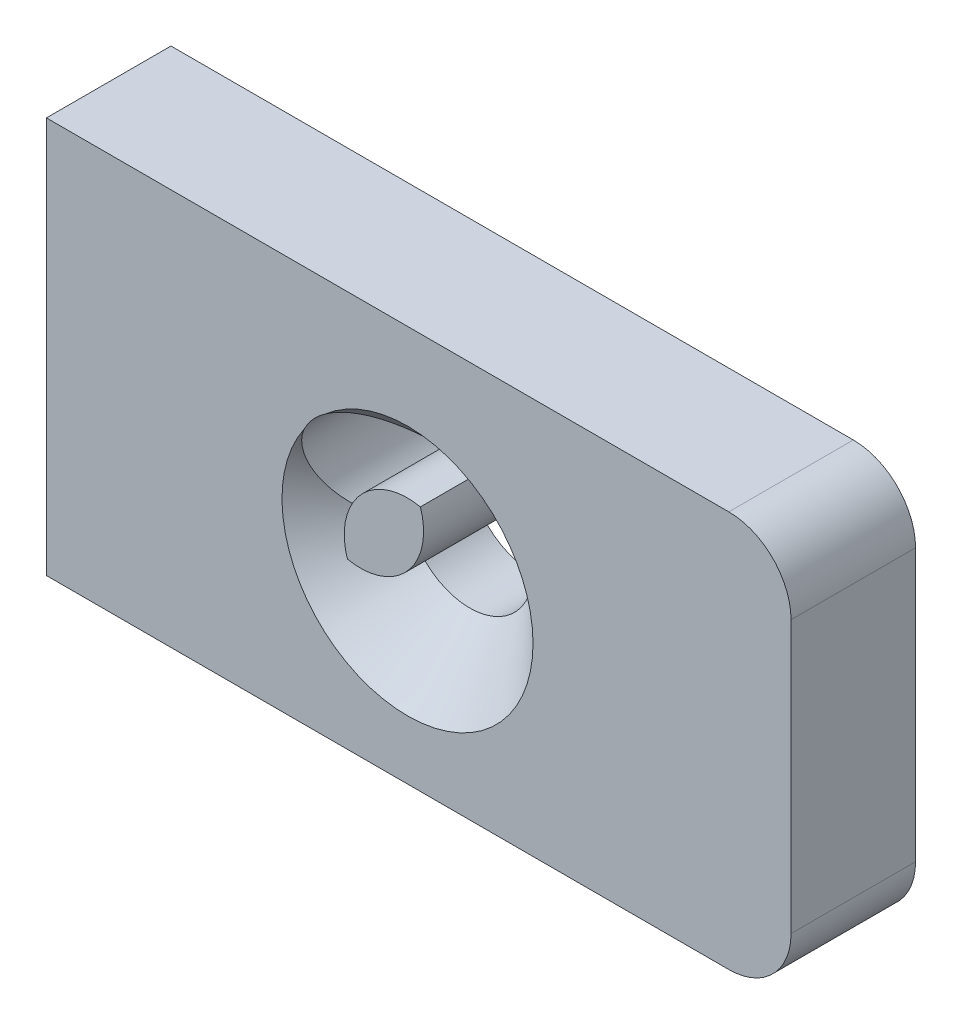
ISO-10303-21;
HEADER;
FILE_DESCRIPTION(('STEP AP214'),'2;1');
FILE_NAME('part.step','',(''),(''),'','','');
FILE_SCHEMA(('AUTOMOTIVE_DESIGN { 1 0 10303 214 1 1 1 1 }'));
ENDSEC;
DATA;
#1=APPLICATION_CONTEXT('core data for automotive mechanical design processes');
#2=APPLICATION_PROTOCOL_DEFINITION('international standard','automotive_design',2000,#1);
#3=PRODUCT_CONTEXT('',#1,'mechanical');
#4=PRODUCT('Part','Part','',(#3));
#5=PRODUCT_RELATED_PRODUCT_CATEGORY('part','',(#4));
#6=PRODUCT_DEFINITION_FORMATION('','',#4);
#7=PRODUCT_DEFINITION_CONTEXT('part definition',#1,'design');
#8=PRODUCT_DEFINITION('design','',#6,#7);
#9=PRODUCT_DEFINITION_SHAPE('','',#8);
#10=(LENGTH_UNIT() NAMED_UNIT(*) SI_UNIT(.MILLI.,.METRE.));
#11=(NAMED_UNIT(*) PLANE_ANGLE_UNIT() SI_UNIT($,.RADIAN.));
#12=(NAMED_UNIT(*) SI_UNIT($,.STERADIAN.) SOLID_ANGLE_UNIT());
#13=UNCERTAINTY_MEASURE_WITH_UNIT(LENGTH_MEASURE(1.E-05),#10,'distance_accuracy_value','');
#14=(GEOMETRIC_REPRESENTATION_CONTEXT(3) GLOBAL_UNCERTAINTY_ASSIGNED_CONTEXT((#13)) GLOBAL_UNIT_ASSIGNED_CONTEXT((#10,
#11,#12)) REPRESENTATION_CONTEXT('',''));
#15=CARTESIAN_POINT('',(0.,0.,0.));
#16=DIRECTION('',(0.,0.,1.));
#17=DIRECTION('',(1.,0.,0.));
#18=AXIS2_PLACEMENT_3D('',#15,#16,#17);
#19=CARTESIAN_POINT('',(0.,0.,20.));
#20=DIRECTION('',(0.,0.,1.));
#21=DIRECTION('',(1.,0.,0.));
#22=AXIS2_PLACEMENT_3D('',#19,#20,#21);
#23=PLANE('',#22);
#24=CARTESIAN_POINT('',(-7.58038538872086,6.76617147373548,20.));
#25=DIRECTION('',(0.,0.,1.));
#26=DIRECTION('',(1.,0.,0.));
#27=AXIS2_PLACEMENT_3D('',#24,#25,#26);
#28=CIRCLE('',#27,10.1608719632483);
#29=CARTESIAN_POINT('',(-13.2357763236887,15.2077277536052,20.));
#30=VERTEX_POINT('',#29);
#31=CARTESIAN_POINT('',(-16.6075997096656,11.4301526762335,20.));
#32=VERTEX_POINT('',#31);
#33=EDGE_CURVE('E146',#30,#32,#28,.T.);
#34=ORIENTED_EDGE('',*,*,#33,.F.);
#35=CARTESIAN_POINT('',(0.,0.,20.));
#36=DIRECTION('',(0.,0.,1.));
#37=DIRECTION('',(1.,0.,0.));
#38=AXIS2_PLACEMENT_3D('',#35,#36,#37);
#39=CIRCLE('',#38,20.1608719632483);
#40=EDGE_CURVE('E13',#30,#32,#39,.F.);
#41=ORIENTED_EDGE('',*,*,#40,.T.);
#42=EDGE_LOOP('',(#34,#41));
#43=FACE_BOUND('',#42,.T.);
#44=DIRECTION('',(1.,0.,0.));
#45=VECTOR('',#44,1.);
#46=CARTESIAN_POINT('',(-57.9946898142679,-29.6417303495147,20.));
#47=LINE('',#46,#45);
#48=CARTESIAN_POINT('',(-57.9946898142679,-29.6417303495147,20.));
#49=VERTEX_POINT('',#48);
#50=CARTESIAN_POINT('',(51.6032482916,-29.6417303495147,20.));
#51=VERTEX_POINT('',#50);
#52=EDGE_CURVE('E197',#49,#51,#47,.T.);
#53=ORIENTED_EDGE('',*,*,#52,.T.);
#54=CARTESIAN_POINT('',(51.6032482916001,-19.6417303495147,20.));
#55=DIRECTION('',(0.,0.,1.));
#56=DIRECTION('',(1.,0.,0.));
#57=AXIS2_PLACEMENT_3D('',#54,#55,#56);
#58=CIRCLE('',#57,10.);
#59=CARTESIAN_POINT('',(61.6032482916001,-19.6417303495147,20.));
#60=VERTEX_POINT('',#59);
#61=EDGE_CURVE('E199',#51,#60,#58,.T.);
#62=ORIENTED_EDGE('',*,*,#61,.T.);
#63=DIRECTION('',(0.,1.,0.));
#64=VECTOR('',#63,1.);
#65=CARTESIAN_POINT('',(61.6032482916001,34.0235513577038,20.));
#66=LINE('',#65,#64);
#67=CARTESIAN_POINT('',(61.6032482916001,24.0235513577038,20.));
#68=VERTEX_POINT('',#67);
#69=EDGE_CURVE('E216',#60,#68,#66,.T.);
#70=ORIENTED_EDGE('',*,*,#69,.T.);
#71=CARTESIAN_POINT('',(51.6032482916001,24.0235513577038,20.));
#72=DIRECTION('',(0.,0.,1.));
#73=DIRECTION('',(1.,0.,0.));
#74=AXIS2_PLACEMENT_3D('',#71,#72,#73);
#75=CIRCLE('',#74,10.);
#76=CARTESIAN_POINT('',(51.6032482916,34.0235513577038,20.));
#77=VERTEX_POINT('',#76);
#78=EDGE_CURVE('E219',#68,#77,#75,.T.);
#79=ORIENTED_EDGE('',*,*,#78,.T.);
#80=DIRECTION('',(-1.,0.,0.));
#81=VECTOR('',#80,1.);
#82=CARTESIAN_POINT('',(-57.9946898142679,34.0235513577038,20.));
#83=LINE('',#82,#81);
#84=CARTESIAN_POINT('',(-57.9946898142679,34.0235513577038,20.));
#85=VERTEX_POINT('',#84);
#86=EDGE_CURVE('E234',#77,#85,#83,.T.);
#87=ORIENTED_EDGE('',*,*,#86,.T.);
#88=DIRECTION('',(0.,-1.,0.));
#89=VECTOR('',#88,1.);
#90=CARTESIAN_POINT('',(-57.9946898142679,34.0235513577038,20.));
#91=LINE('',#90,#89);
#92=EDGE_CURVE('E202',#85,#49,#91,.T.);
#93=ORIENTED_EDGE('',*,*,#92,.T.);
#94=EDGE_LOOP('',(#53,#62,#70,#79,#87,#93));
#95=FACE_BOUND('',#94,.T.);
#96=ADVANCED_FACE('F65',(#43,#95),#23,.T.);
#97=CARTESIAN_POINT('',(0.,0.,0.));
#98=DIRECTION('',(0.,0.,1.));
#99=DIRECTION('',(1.,0.,0.));
#100=AXIS2_PLACEMENT_3D('',#97,#98,#99);
#101=PLANE('',#100);
#102=DIRECTION('',(0.,1.,0.));
#103=VECTOR('',#102,1.);
#104=CARTESIAN_POINT('',(61.6032482916001,34.0235513577038,0.));
#105=LINE('',#104,#103);
#106=CARTESIAN_POINT('',(61.6032482916001,-19.6417303495147,0.));
#107=VERTEX_POINT('',#106);
#108=CARTESIAN_POINT('',(61.6032482916001,24.0235513577038,0.));
#109=VERTEX_POINT('',#108);
#110=EDGE_CURVE('E231',#107,#109,#105,.T.);
#111=ORIENTED_EDGE('',*,*,#110,.F.);
#112=CARTESIAN_POINT('',(51.6032482916001,-19.6417303495147,0.));
#113=DIRECTION('',(0.,0.,1.));
#114=DIRECTION('',(1.,0.,0.));
#115=AXIS2_PLACEMENT_3D('',#112,#113,#114);
#116=CIRCLE('',#115,10.);
#117=CARTESIAN_POINT('',(51.6032482916,-29.6417303495147,0.));
#118=VERTEX_POINT('',#117);
#119=EDGE_CURVE('E226',#107,#118,#116,.F.);
#120=ORIENTED_EDGE('',*,*,#119,.T.);
#121=DIRECTION('',(1.,0.,0.));
#122=VECTOR('',#121,1.);
#123=CARTESIAN_POINT('',(-57.9946898142679,-29.6417303495147,0.));
#124=LINE('',#123,#122);
#125=CARTESIAN_POINT('',(-57.9946898142679,-29.6417303495147,0.));
#126=VERTEX_POINT('',#125);
#127=EDGE_CURVE('E225',#126,#118,#124,.T.);
#128=ORIENTED_EDGE('',*,*,#127,.F.);
#129=DIRECTION('',(0.,-1.,0.));
#130=VECTOR('',#129,1.);
#131=CARTESIAN_POINT('',(-57.9946898142679,34.0235513577038,0.));
#132=LINE('',#131,#130);
#133=CARTESIAN_POINT('',(-57.9946898142679,34.0235513577038,0.));
#134=VERTEX_POINT('',#133);
#135=EDGE_CURVE('E159',#134,#126,#132,.T.);
#136=ORIENTED_EDGE('',*,*,#135,.F.);
#137=DIRECTION('',(-1.,0.,0.));
#138=VECTOR('',#137,1.);
#139=CARTESIAN_POINT('',(-57.9946898142679,34.0235513577038,0.));
#140=LINE('',#139,#138);
#141=CARTESIAN_POINT('',(51.6032482916,34.0235513577038,0.));
#142=VERTEX_POINT('',#141);
#143=EDGE_CURVE('E147',#142,#134,#140,.T.);
#144=ORIENTED_EDGE('',*,*,#143,.F.);
#145=CARTESIAN_POINT('',(51.6032482916001,24.0235513577038,0.));
#146=DIRECTION('',(0.,0.,1.));
#147=DIRECTION('',(1.,0.,0.));
#148=AXIS2_PLACEMENT_3D('',#145,#146,#147);
#149=CIRCLE('',#148,10.);
#150=EDGE_CURVE('E155',#142,#109,#149,.F.);
#151=ORIENTED_EDGE('',*,*,#150,.T.);
#152=EDGE_LOOP('',(#111,#120,#128,#136,#144,#151));
#153=FACE_BOUND('',#152,.T.);
#154=CARTESIAN_POINT('',(0.,0.,0.));
#155=DIRECTION('',(0.,0.,1.));
#156=DIRECTION('',(1.,0.,0.));
#157=AXIS2_PLACEMENT_3D('',#154,#155,#156);
#158=CIRCLE('',#157,10.1608719632483);
#159=CARTESIAN_POINT('',(-9.64986907697695,-3.1817205802409,0.));
#160=VERTEX_POINT('',#159);
#161=CARTESIAN_POINT('',(2.06948368825609,9.94789205397638,0.));
#162=VERTEX_POINT('',#161);
#163=EDGE_CURVE('E150',#160,#162,#158,.T.);
#164=ORIENTED_EDGE('',*,*,#163,.T.);
#165=CARTESIAN_POINT('',(-7.58038538872086,6.76617147373548,0.));
#166=DIRECTION('',(0.,0.,1.));
#167=DIRECTION('',(1.,0.,0.));
#168=AXIS2_PLACEMENT_3D('',#165,#166,#167);
#169=CIRCLE('',#168,10.1608719632483);
#170=EDGE_CURVE('E138',#162,#160,#169,.T.);
#171=ORIENTED_EDGE('',*,*,#170,.T.);
#172=EDGE_LOOP('',(#164,#171));
#173=FACE_BOUND('',#172,.T.);
#174=ADVANCED_FACE('F157',(#153,#173),#101,.F.);
#175=CARTESIAN_POINT('',(-57.9946898142679,34.0235513577038,20.));
#176=DIRECTION('',(1.,0.,0.));
#177=DIRECTION('',(0.,0.,-1.));
#178=AXIS2_PLACEMENT_3D('',#175,#176,#177);
#179=PLANE('',#178);
#180=ORIENTED_EDGE('',*,*,#135,.T.);
#181=DIRECTION('',(0.,0.,-1.));
#182=VECTOR('',#181,1.);
#183=CARTESIAN_POINT('',(-57.9946898142679,-29.6417303495147,20.));
#184=LINE('',#183,#182);
#185=EDGE_CURVE('E224',#49,#126,#184,.T.);
#186=ORIENTED_EDGE('',*,*,#185,.F.);
#187=ORIENTED_EDGE('',*,*,#92,.F.);
#188=DIRECTION('',(0.,0.,-1.));
#189=VECTOR('',#188,1.);
#190=CARTESIAN_POINT('',(-57.9946898142679,34.0235513577038,20.));
#191=LINE('',#190,#189);
#192=EDGE_CURVE('E163',#85,#134,#191,.T.);
#193=ORIENTED_EDGE('',*,*,#192,.T.);
#194=EDGE_LOOP('',(#180,#186,#187,#193));
#195=FACE_BOUND('',#194,.T.);
#196=ADVANCED_FACE('F189',(#195),#179,.F.);
#197=CARTESIAN_POINT('',(-57.9946898142679,-29.6417303495147,20.));
#198=DIRECTION('',(0.,1.,0.));
#199=DIRECTION('',(0.,0.,1.));
#200=AXIS2_PLACEMENT_3D('',#197,#198,#199);
#201=PLANE('',#200);
#202=ORIENTED_EDGE('',*,*,#127,.T.);
#203=DIRECTION('',(0.,0.,-1.));
#204=VECTOR('',#203,1.);
#205=CARTESIAN_POINT('',(51.6032482916001,-29.6417303495147,20.));
#206=LINE('',#205,#204);
#207=EDGE_CURVE('E212',#118,#51,#206,.F.);
#208=ORIENTED_EDGE('',*,*,#207,.T.);
#209=ORIENTED_EDGE('',*,*,#52,.F.);
#210=ORIENTED_EDGE('',*,*,#185,.T.);
#211=EDGE_LOOP('',(#202,#208,#209,#210));
#212=FACE_BOUND('',#211,.T.);
#213=ADVANCED_FACE('F270',(#212),#201,.F.);
#214=CARTESIAN_POINT('',(61.6032482916001,34.0235513577038,20.));
#215=DIRECTION('',(-1.,0.,0.));
#216=DIRECTION('',(0.,0.,1.));
#217=AXIS2_PLACEMENT_3D('',#214,#215,#216);
#218=PLANE('',#217);
#219=ORIENTED_EDGE('',*,*,#69,.F.);
#220=DIRECTION('',(0.,0.,-1.));
#221=VECTOR('',#220,1.);
#222=CARTESIAN_POINT('',(61.6032482916001,-19.6417303495147,20.));
#223=LINE('',#222,#221);
#224=EDGE_CURVE('E214',#60,#107,#223,.T.);
#225=ORIENTED_EDGE('',*,*,#224,.T.);
#226=ORIENTED_EDGE('',*,*,#110,.T.);
#227=DIRECTION('',(0.,0.,-1.));
#228=VECTOR('',#227,1.);
#229=CARTESIAN_POINT('',(61.6032482916001,24.0235513577038,20.));
#230=LINE('',#229,#228);
#231=EDGE_CURVE('E235',#109,#68,#230,.F.);
#232=ORIENTED_EDGE('',*,*,#231,.T.);
#233=EDGE_LOOP('',(#219,#225,#226,#232));
#234=FACE_BOUND('',#233,.T.);
#235=ADVANCED_FACE('F273',(#234),#218,.F.);
#236=CARTESIAN_POINT('',(-57.9946898142679,34.0235513577038,20.));
#237=DIRECTION('',(0.,-1.,0.));
#238=DIRECTION('',(0.,0.,-1.));
#239=AXIS2_PLACEMENT_3D('',#236,#237,#238);
#240=PLANE('',#239);
#241=ORIENTED_EDGE('',*,*,#86,.F.);
#242=DIRECTION('',(0.,0.,-1.));
#243=VECTOR('',#242,1.);
#244=CARTESIAN_POINT('',(51.6032482916001,34.0235513577038,20.));
#245=LINE('',#244,#243);
#246=EDGE_CURVE('E239',#77,#142,#245,.T.);
#247=ORIENTED_EDGE('',*,*,#246,.T.);
#248=ORIENTED_EDGE('',*,*,#143,.T.);
#249=ORIENTED_EDGE('',*,*,#192,.F.);
#250=EDGE_LOOP('',(#241,#247,#248,#249));
#251=FACE_BOUND('',#250,.T.);
#252=ADVANCED_FACE('F266',(#251),#240,.F.);
#253=CARTESIAN_POINT('',(51.6032482916001,24.0235513577038,20.));
#254=DIRECTION('',(0.,0.,-1.));
#255=DIRECTION('',(-1.,0.,0.));
#256=AXIS2_PLACEMENT_3D('',#253,#254,#255);
#257=CYLINDRICAL_SURFACE('',#256,10.);
#258=ORIENTED_EDGE('',*,*,#78,.F.);
#259=ORIENTED_EDGE('',*,*,#231,.F.);
#260=ORIENTED_EDGE('',*,*,#150,.F.);
#261=ORIENTED_EDGE('',*,*,#246,.F.);
#262=EDGE_LOOP('',(#258,#259,#260,#261));
#263=FACE_BOUND('',#262,.T.);
#264=ADVANCED_FACE('F276',(#263),#257,.T.);
#265=CARTESIAN_POINT('',(51.6032482916001,-19.6417303495147,20.));
#266=DIRECTION('',(0.,0.,-1.));
#267=DIRECTION('',(-1.,0.,0.));
#268=AXIS2_PLACEMENT_3D('',#265,#266,#267);
#269=CYLINDRICAL_SURFACE('',#268,10.);
#270=ORIENTED_EDGE('',*,*,#61,.F.);
#271=ORIENTED_EDGE('',*,*,#207,.F.);
#272=ORIENTED_EDGE('',*,*,#119,.F.);
#273=ORIENTED_EDGE('',*,*,#224,.F.);
#274=EDGE_LOOP('',(#270,#271,#272,#273));
#275=FACE_BOUND('',#274,.T.);
#276=ADVANCED_FACE('F211',(#275),#269,.T.);
#277=CARTESIAN_POINT('',(0.,0.,0.));
#278=DIRECTION('',(0.,0.,1.));
#279=DIRECTION('',(1.,0.,0.));
#280=AXIS2_PLACEMENT_3D('',#277,#278,#279);
#281=CYLINDRICAL_SURFACE('',#280,10.1608719632483);
#282=DIRECTION('',(0.,0.,1.));
#283=VECTOR('',#282,1.);
#284=CARTESIAN_POINT('',(-9.64986907697695,-3.1817205802409,0.));
#285=LINE('',#284,#283);
#286=CARTESIAN_POINT('',(-9.64986907697695,-3.1817205802409,9.99999999999995));
#287=VERTEX_POINT('',#286);
#288=EDGE_CURVE('E134',#160,#287,#285,.T.);
#289=ORIENTED_EDGE('',*,*,#288,.T.);
#290=CARTESIAN_POINT('',(0.,0.,9.99999999999995));
#291=DIRECTION('',(0.,0.,1.));
#292=DIRECTION('',(1.,0.,0.));
#293=AXIS2_PLACEMENT_3D('',#290,#291,#292);
#294=CIRCLE('',#293,10.1608719632483);
#295=CARTESIAN_POINT('',(2.06948368825609,9.94789205397638,9.99999999999995));
#296=VERTEX_POINT('',#295);
#297=EDGE_CURVE('E169',#287,#296,#294,.T.);
#298=ORIENTED_EDGE('',*,*,#297,.T.);
#299=DIRECTION('',(0.,0.,1.));
#300=VECTOR('',#299,1.);
#301=CARTESIAN_POINT('',(2.06948368825609,9.94789205397638,0.));
#302=LINE('',#301,#300);
#303=EDGE_CURVE('E152',#162,#296,#302,.T.);
#304=ORIENTED_EDGE('',*,*,#303,.F.);
#305=ORIENTED_EDGE('',*,*,#163,.F.);
#306=EDGE_LOOP('',(#289,#298,#304,#305));
#307=FACE_BOUND('',#306,.T.);
#308=ADVANCED_FACE('F151',(#307),#281,.F.);
#309=CARTESIAN_POINT('',(-7.58038538872086,6.76617147373548,0.));
#310=DIRECTION('',(0.,0.,1.));
#311=DIRECTION('',(1.,0.,0.));
#312=AXIS2_PLACEMENT_3D('',#309,#310,#311);
#313=CYLINDRICAL_SURFACE('',#312,10.1608719632483);
#314=ORIENTED_EDGE('',*,*,#303,.T.);
#315=CARTESIAN_POINT('',(2.06948368825609,9.94789205397638,9.99999999999995));
#316=CARTESIAN_POINT('',(1.95728261262066,10.2883183847336,10.310450073373));
#317=CARTESIAN_POINT('',(1.82621606384262,10.6251206752892,10.6182296100901));
#318=CARTESIAN_POINT('',(1.52627049200635,11.2877102574175,11.2278257541974));
#319=CARTESIAN_POINT('',(1.35735591678533,11.6134868587629,11.5296364628407));
#320=CARTESIAN_POINT('',(0.981183176423882,12.2507209870293,12.1271345942748));
#321=CARTESIAN_POINT('',(0.773792023835567,12.5621240247029,12.4227966989151));
#322=CARTESIAN_POINT('',(0.321663023126599,13.164824215418,13.0057193233157));
#323=CARTESIAN_POINT('',(0.0769420238573423,13.4561303534929,13.2929835641));
#324=CARTESIAN_POINT('',(-0.401016079344396,13.9632770198108,13.8065543979624));
#325=CARTESIAN_POINT('',(-0.628238290970372,14.18320352823,14.0344406036951));
#326=CARTESIAN_POINT('',(-1.10621471622454,14.6038851514946,14.4831081427208));
#327=CARTESIAN_POINT('',(-1.35696564019042,14.8046429385156,14.7038904634628));
#328=CARTESIAN_POINT('',(-1.88056886644135,15.1839970782481,15.1372593641729));
#329=CARTESIAN_POINT('',(-2.15339088886409,15.3626229697346,15.3498566013472));
#330=CARTESIAN_POINT('',(-2.72001017819011,15.6952242688068,15.7662733355382));
#331=CARTESIAN_POINT('',(-3.01380752146614,15.8491995866312,15.9700928005901));
#332=CARTESIAN_POINT('',(-3.62293345789521,16.1307502203805,16.3695091767707));
#333=CARTESIAN_POINT('',(-3.93841174756787,16.2581108813239,16.5650298020825));
#334=CARTESIAN_POINT('',(-4.58649810458672,16.4820072106736,16.9450074931349));
#335=CARTESIAN_POINT('',(-4.91910378788425,16.5785471557748,17.1294660909595));
#336=CARTESIAN_POINT('',(-5.59872489379761,16.7380411640105,17.4861593363271));
#337=CARTESIAN_POINT('',(-5.94574215062154,16.8009909378074,17.658392420285));
#338=CARTESIAN_POINT('',(-6.65075139415842,16.8906614848039,17.9892825052596));
#339=CARTESIAN_POINT('',(-7.00874093653315,16.9173902679605,18.1479425005736));
#340=CARTESIAN_POINT('',(-7.6830164638396,16.9313418227844,18.4299402165688));
#341=CARTESIAN_POINT('',(-7.99842100316607,16.9234031613581,18.555156628718));
#342=CARTESIAN_POINT('',(-8.63158117278213,16.8775025206931,18.793488310216));
#343=CARTESIAN_POINT('',(-8.94933628114545,16.8395470193177,18.906606184543));
#344=CARTESIAN_POINT('',(-9.58339246885155,16.7328352552948,19.1196209689325));
#345=CARTESIAN_POINT('',(-9.89969519966075,16.6641436643343,19.2195450711759));
#346=CARTESIAN_POINT('',(-10.5278661966449,16.4955830301492,19.4055046968647));
#347=CARTESIAN_POINT('',(-10.8397363757891,16.3957278915565,19.4915463884777));
#348=CARTESIAN_POINT('',(-11.5107222916938,16.1441146379941,19.6630466929402));
#349=CARTESIAN_POINT('',(-11.8683327828126,15.9862730221243,19.7456589180547));
#350=CARTESIAN_POINT('',(-12.3917313630683,15.7178682403084,19.853349554342));
#351=CARTESIAN_POINT('',(-12.5641181368138,15.6230661380276,19.8865554379661));
#352=CARTESIAN_POINT('',(-12.9038889010662,15.4231044001988,19.9474485125679));
#353=CARTESIAN_POINT('',(-13.0712706057503,15.3179401236313,19.975133213773));
#354=CARTESIAN_POINT('',(-13.2357763236887,15.2077277536052,20.));
#355=B_SPLINE_CURVE_WITH_KNOTS('',3,(#315,#316,#317,#318,#319,#320,#321,#322,#323,#324,#325,
#326,#327,#328,#329,#330,#331,#332,#333,#334,#335,#336,#337,#338,#339,#340,#341,#342,#343,#344,
#345,#346,#347,#348,#349,#350,#351,#352,#353,#354),.UNSPECIFIED.,.F.,.F.,(4,2,2,2,2,2,2,2,2,2,2,
2,2,2,2,2,2,2,2,4),(0.,1.42235781356867,2.84605734789376,4.27477255532066,5.7028448088648,
6.87102957739026,8.03905125906975,9.20549682895931,10.3719466461832,11.5474691375527,
12.7228284419793,13.8983377994433,15.0735871607923,16.0904548832896,17.1071032178302,
18.1216224128086,19.135689592606,20.3307945323988,20.9289973092325,21.5274692381222),.UNSPECIFIED.);
#356=EDGE_CURVE('E76',#296,#30,#355,.T.);
#357=ORIENTED_EDGE('',*,*,#356,.T.);
#358=ORIENTED_EDGE('',*,*,#33,.T.);
#359=CARTESIAN_POINT('',(-16.6075997096656,11.4301526762335,20.));
#360=CARTESIAN_POINT('',(-16.7336551583718,11.1862674623534,19.9655388732278));
#361=CARTESIAN_POINT('',(-16.8494145004776,10.9378817096178,19.9256220772623));
#362=CARTESIAN_POINT('',(-17.0599390344387,10.4343541608468,19.8352576994337));
#363=CARTESIAN_POINT('',(-17.1547137974264,10.1792155045266,19.7848149389731));
#364=CARTESIAN_POINT('',(-17.3226203732389,9.66531055319578,19.673986448805));
#365=CARTESIAN_POINT('',(-17.3958437341794,9.40656464049671,19.6136445240511));
#366=CARTESIAN_POINT('',(-17.5211853336365,8.88640164601842,19.4832814214801));
#367=CARTESIAN_POINT('',(-17.5733017681788,8.62498433787623,19.4132594170081));
#368=CARTESIAN_POINT('',(-17.6565515270623,8.10191699593289,19.2641221760158));
#369=CARTESIAN_POINT('',(-17.6877207717827,7.84026813490522,19.1850227796545));
#370=CARTESIAN_POINT('',(-17.7296422530525,7.31803506683034,19.0180792971196));
#371=CARTESIAN_POINT('',(-17.740386880484,7.05745129263872,18.9302319647552));
#372=CARTESIAN_POINT('',(-17.7420265715946,6.53904174592294,18.7462646906003));
#373=CARTESIAN_POINT('',(-17.7329127840069,6.28121725473325,18.6501410782582));
#374=CARTESIAN_POINT('',(-17.6955493671687,5.76992259835151,18.4501125654136));
#375=CARTESIAN_POINT('',(-17.6672927388147,5.51645406057394,18.3462048312038));
#376=CARTESIAN_POINT('',(-17.5900326236379,4.99892919155742,18.1240619290333));
#377=CARTESIAN_POINT('',(-17.539789395199,4.73526952802066,18.0053340197349));
#378=CARTESIAN_POINT('',(-17.4196705864023,4.21611478462652,17.7601929856523));
#379=CARTESIAN_POINT('',(-17.349793049273,3.96062052136772,17.6337790958613));
#380=CARTESIAN_POINT('',(-17.1916084547813,3.45907742910858,17.3737896727589));
#381=CARTESIAN_POINT('',(-17.10329623219,3.21303127030482,17.2402121400721));
#382=CARTESIAN_POINT('',(-16.9095531133745,2.73166316958167,16.9664860151007));
#383=CARTESIAN_POINT('',(-16.8041255606222,2.49633914457374,16.8263387100134));
#384=CARTESIAN_POINT('',(-16.563422601231,2.00895934280288,16.5222351266178));
#385=CARTESIAN_POINT('',(-16.4260687486614,1.75842906716746,16.3574766944844));
#386=CARTESIAN_POINT('',(-16.1332250278768,1.27321515753098,16.0209090107044));
#387=CARTESIAN_POINT('',(-15.9777338202379,1.03853269589693,15.8490992389322));
#388=CARTESIAN_POINT('',(-15.6504390819364,0.585916085151912,15.4990187675955));
#389=CARTESIAN_POINT('',(-15.4786332712049,0.367984284775315,15.3207471671086));
#390=CARTESIAN_POINT('',(-15.1204836701084,-0.0504339559855971,14.9582735339172));
#391=CARTESIAN_POINT('',(-14.9341349189213,-0.250914393673132,14.77406949026));
#392=CARTESIAN_POINT('',(-14.521873204495,-0.66045724496857,14.3742775329719));
#393=CARTESIAN_POINT('',(-14.2940631022668,-0.866831985917546,14.1578892487841));
#394=CARTESIAN_POINT('',(-13.8244203690671,-1.25556741400512,13.7188364982122));
#395=CARTESIAN_POINT('',(-13.582586001586,-1.43792511812726,13.4961712563656));
#396=CARTESIAN_POINT('',(-13.0872017069997,-1.77833801071348,13.0451063323978));
#397=CARTESIAN_POINT('',(-12.8336466330951,-1.9363823883009,12.8167041515635));
#398=CARTESIAN_POINT('',(-12.3172898402221,-2.22788071099762,12.3548979683983));
#399=CARTESIAN_POINT('',(-12.0544895933654,-2.36133855011089,12.1214947646749));
#400=CARTESIAN_POINT('',(-11.4403123067284,-2.64074999303465,11.5780810408416));
#401=CARTESIAN_POINT('',(-11.08639609961,-2.77807131761094,11.2664449085549));
#402=CARTESIAN_POINT('',(-10.5504803307817,-2.95273164634282,10.7945255758304));
#403=CARTESIAN_POINT('',(-10.3712410601073,-3.00568221951834,10.6366859196515));
#404=CARTESIAN_POINT('',(-10.0114370830234,-3.10134752376477,10.3194784290031));
#405=CARTESIAN_POINT('',(-9.83087258216554,-3.14406380904804,10.1601108303999));
#406=CARTESIAN_POINT('',(-9.64986907697695,-3.1817205802409,9.99999999999996));
#407=B_SPLINE_CURVE_WITH_KNOTS('',3,(#359,#360,#361,#362,#363,#364,#365,#366,#367,#368,#369,
#370,#371,#372,#373,#374,#375,#376,#377,#378,#379,#380,#381,#382,#383,#384,#385,#386,#387,#388,
#389,#390,#391,#392,#393,#394,#395,#396,#397,#398,#399,#400,#401,#402,#403,#404,#405,#406),
.UNSPECIFIED.,.F.,.F.,(4,2,2,2,2,2,2,2,2,2,2,2,2,2,2,2,2,2,2,2,2,2,2,4),(0.,0.829728635989711,
1.65907804698515,2.4848518650579,3.31069624577627,4.13512082475407,4.95985248000455,
5.78495180877086,6.61035297751209,7.48991723080761,8.36956917331788,9.24946791782055,
10.1291949808881,11.1176246700986,12.1061274000303,13.0947684833558,14.0837482940387,
15.2103448030438,16.3370811083522,17.4643169757943,18.591374158398,20.0626506921917,
20.7963572824225,21.5299523788495),.UNSPECIFIED.);
#408=EDGE_CURVE('E141',#32,#287,#407,.T.);
#409=ORIENTED_EDGE('',*,*,#408,.T.);
#410=ORIENTED_EDGE('',*,*,#288,.F.);
#411=ORIENTED_EDGE('',*,*,#170,.F.);
#412=EDGE_LOOP('',(#314,#357,#358,#409,#410,#411));
#413=FACE_BOUND('',#412,.T.);
#414=ADVANCED_FACE('F136',(#413),#313,.F.);
#415=CARTESIAN_POINT('',(0.,0.,9.99999999999995));
#416=DIRECTION('',(0.,0.,1.));
#417=DIRECTION('',(1.,0.,0.));
#418=AXIS2_PLACEMENT_3D('',#415,#416,#417);
#419=CONICAL_SURFACE('',#418,10.1608719632483,0.78539816339745);
#420=ORIENTED_EDGE('',*,*,#408,.F.);
#421=ORIENTED_EDGE('',*,*,#40,.F.);
#422=ORIENTED_EDGE('',*,*,#356,.F.);
#423=ORIENTED_EDGE('',*,*,#297,.F.);
#424=EDGE_LOOP('',(#420,#421,#422,#423));
#425=FACE_BOUND('',#424,.T.);
#426=ADVANCED_FACE('F68',(#425),#419,.F.);
#427=CLOSED_SHELL('',(#96,#174,#196,#213,#235,#252,#264,#276,#308,#414,#426));
#428=MANIFOLD_SOLID_BREP('B2',#427);
#429=CARTESIAN_POINT('',(-7.58038538872086,6.76617147373548,0.));
#430=DIRECTION('',(0.,0.,1.));
#431=DIRECTION('',(1.,0.,0.));
#432=AXIS2_PLACEMENT_3D('',#429,#430,#431);
#433=CYLINDRICAL_SURFACE('',#432,10.1608719632483);
#434=CARTESIAN_POINT('',(-7.58038538872086,6.76617147373548,20.));
#435=DIRECTION('',(0.,0.,1.));
#436=DIRECTION('',(1.,0.,0.));
#437=AXIS2_PLACEMENT_3D('',#434,#435,#436);
#438=CIRCLE('',#437,10.1608719632483);
#439=CARTESIAN_POINT('',(-9.64986907697695,-3.1817205802409,20.));
#440=VERTEX_POINT('',#439);
#441=CARTESIAN_POINT('',(2.06948368825609,9.94789205397638,20.));
#442=VERTEX_POINT('',#441);
#443=EDGE_CURVE('E392',#440,#442,#438,.T.);
#444=ORIENTED_EDGE('',*,*,#443,.F.);
#445=DIRECTION('',(0.,0.,1.));
#446=VECTOR('',#445,1.);
#447=CARTESIAN_POINT('',(-9.64986907697695,-3.1817205802409,0.));
#448=LINE('',#447,#446);
#449=CARTESIAN_POINT('',(-9.64986907697695,-3.1817205802409,0.));
#450=VERTEX_POINT('',#449);
#451=EDGE_CURVE('E63',#450,#440,#448,.T.);
#452=ORIENTED_EDGE('',*,*,#451,.F.);
#453=CARTESIAN_POINT('',(-7.58038538872086,6.76617147373548,0.));
#454=DIRECTION('',(0.,0.,1.));
#455=DIRECTION('',(1.,0.,0.));
#456=AXIS2_PLACEMENT_3D('',#453,#454,#455);
#457=CIRCLE('',#456,10.1608719632483);
#458=CARTESIAN_POINT('',(2.06948368825609,9.94789205397638,0.));
#459=VERTEX_POINT('',#458);
#460=EDGE_CURVE('E396',#450,#459,#457,.T.);
#461=ORIENTED_EDGE('',*,*,#460,.T.);
#462=DIRECTION('',(0.,0.,1.));
#463=VECTOR('',#462,1.);
#464=CARTESIAN_POINT('',(2.06948368825609,9.94789205397638,0.));
#465=LINE('',#464,#463);
#466=EDGE_CURVE('E373',#459,#442,#465,.T.);
#467=ORIENTED_EDGE('',*,*,#466,.T.);
#468=EDGE_LOOP('',(#444,#452,#461,#467));
#469=FACE_BOUND('',#468,.T.);
#470=ADVANCED_FACE('F365',(#469),#433,.T.);
#471=CARTESIAN_POINT('',(0.,0.,0.));
#472=DIRECTION('',(0.,0.,1.));
#473=DIRECTION('',(1.,0.,0.));
#474=AXIS2_PLACEMENT_3D('',#471,#472,#473);
#475=PLANE('',#474);
#476=CARTESIAN_POINT('',(0.,0.,0.));
#477=DIRECTION('',(0.,0.,1.));
#478=DIRECTION('',(1.,0.,0.));
#479=AXIS2_PLACEMENT_3D('',#476,#477,#478);
#480=CIRCLE('',#479,10.1608719632483);
#481=EDGE_CURVE('E388',#459,#450,#480,.T.);
#482=ORIENTED_EDGE('',*,*,#481,.F.);
#483=ORIENTED_EDGE('',*,*,#460,.F.);
#484=EDGE_LOOP('',(#482,#483));
#485=FACE_BOUND('',#484,.T.);
#486=ADVANCED_FACE('F367',(#485),#475,.F.);
#487=CARTESIAN_POINT('',(0.,0.,20.));
#488=DIRECTION('',(0.,0.,1.));
#489=DIRECTION('',(1.,0.,0.));
#490=AXIS2_PLACEMENT_3D('',#487,#488,#489);
#491=PLANE('',#490);
#492=ORIENTED_EDGE('',*,*,#443,.T.);
#493=CARTESIAN_POINT('',(0.,0.,20.));
#494=DIRECTION('',(0.,0.,1.));
#495=DIRECTION('',(1.,0.,0.));
#496=AXIS2_PLACEMENT_3D('',#493,#494,#495);
#497=CIRCLE('',#496,10.1608719632483);
#498=EDGE_CURVE('E393',#442,#440,#497,.T.);
#499=ORIENTED_EDGE('',*,*,#498,.T.);
#500=EDGE_LOOP('',(#492,#499));
#501=FACE_BOUND('',#500,.T.);
#502=ADVANCED_FACE('F403',(#501),#491,.T.);
#503=CARTESIAN_POINT('',(0.,0.,0.));
#504=DIRECTION('',(0.,0.,1.));
#505=DIRECTION('',(1.,0.,0.));
#506=AXIS2_PLACEMENT_3D('',#503,#504,#505);
#507=CYLINDRICAL_SURFACE('',#506,10.1608719632483);
#508=ORIENTED_EDGE('',*,*,#498,.F.);
#509=ORIENTED_EDGE('',*,*,#466,.F.);
#510=ORIENTED_EDGE('',*,*,#481,.T.);
#511=ORIENTED_EDGE('',*,*,#451,.T.);
#512=EDGE_LOOP('',(#508,#509,#510,#511));
#513=FACE_BOUND('',#512,.T.);
#514=ADVANCED_FACE('F389',(#513),#507,.T.);
#515=CLOSED_SHELL('',(#470,#486,#502,#514));
#516=MANIFOLD_SOLID_BREP('B7',#515);
#517=ADVANCED_BREP_SHAPE_REPRESENTATION('',(#18,#428,#516),#14);
#518=SHAPE_DEFINITION_REPRESENTATION(#9,#517);
ENDSEC;
END-ISO-10303-21;
